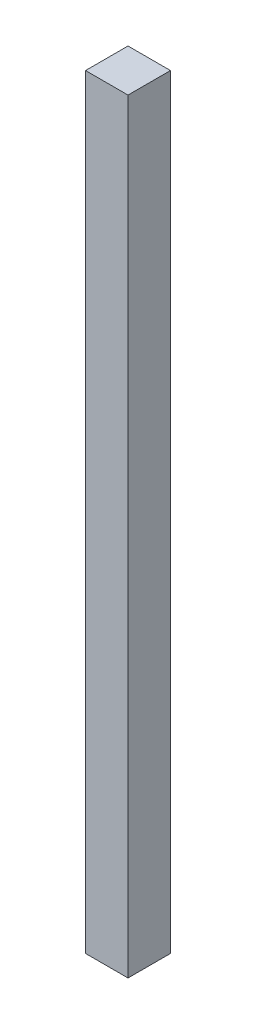
ISO-10303-21;
HEADER;
FILE_DESCRIPTION(('STEP AP214'),'2;1');
FILE_NAME('part.step','',(''),(''),'','','');
FILE_SCHEMA(('AUTOMOTIVE_DESIGN { 1 0 10303 214 1 1 1 1 }'));
ENDSEC;
DATA;
#1=APPLICATION_CONTEXT('core data for automotive mechanical design processes');
#2=APPLICATION_PROTOCOL_DEFINITION('international standard','automotive_design',2000,#1);
#3=PRODUCT_CONTEXT('',#1,'mechanical');
#4=PRODUCT('Part','Part','',(#3));
#5=PRODUCT_RELATED_PRODUCT_CATEGORY('part','',(#4));
#6=PRODUCT_DEFINITION_FORMATION('','',#4);
#7=PRODUCT_DEFINITION_CONTEXT('part definition',#1,'design');
#8=PRODUCT_DEFINITION('design','',#6,#7);
#9=PRODUCT_DEFINITION_SHAPE('','',#8);
#10=(LENGTH_UNIT() NAMED_UNIT(*) SI_UNIT(.MILLI.,.METRE.));
#11=(NAMED_UNIT(*) PLANE_ANGLE_UNIT() SI_UNIT($,.RADIAN.));
#12=(NAMED_UNIT(*) SI_UNIT($,.STERADIAN.) SOLID_ANGLE_UNIT());
#13=UNCERTAINTY_MEASURE_WITH_UNIT(LENGTH_MEASURE(1.E-05),#10,'distance_accuracy_value','');
#14=(GEOMETRIC_REPRESENTATION_CONTEXT(3) GLOBAL_UNCERTAINTY_ASSIGNED_CONTEXT((#13)) GLOBAL_UNIT_ASSIGNED_CONTEXT((#10,
#11,#12)) REPRESENTATION_CONTEXT('',''));
#15=CARTESIAN_POINT('',(0.,0.,0.));
#16=DIRECTION('',(0.,0.,1.));
#17=DIRECTION('',(1.,0.,0.));
#18=AXIS2_PLACEMENT_3D('',#15,#16,#17);
#19=CARTESIAN_POINT('',(0.,685.8,0.));
#20=DIRECTION('',(1.,0.,0.));
#21=DIRECTION('',(0.,0.,-1.));
#22=AXIS2_PLACEMENT_3D('',#19,#20,#21);
#23=PLANE('',#22);
#24=DIRECTION('',(0.,0.,1.));
#25=VECTOR('',#24,1.);
#26=CARTESIAN_POINT('',(0.,0.,0.));
#27=LINE('',#26,#25);
#28=CARTESIAN_POINT('',(0.,0.,0.));
#29=VERTEX_POINT('',#28);
#30=CARTESIAN_POINT('',(0.,0.,38.1));
#31=VERTEX_POINT('',#30);
#32=EDGE_CURVE('E96',#29,#31,#27,.T.);
#33=ORIENTED_EDGE('',*,*,#32,.T.);
#34=DIRECTION('',(0.,-1.,0.));
#35=VECTOR('',#34,1.);
#36=CARTESIAN_POINT('',(0.,685.8,38.1));
#37=LINE('',#36,#35);
#38=CARTESIAN_POINT('',(0.,685.8,38.1));
#39=VERTEX_POINT('',#38);
#40=EDGE_CURVE('E11',#39,#31,#37,.T.);
#41=ORIENTED_EDGE('',*,*,#40,.F.);
#42=DIRECTION('',(0.,0.,1.));
#43=VECTOR('',#42,1.);
#44=CARTESIAN_POINT('',(0.,685.8,0.));
#45=LINE('',#44,#43);
#46=CARTESIAN_POINT('',(0.,685.8,0.));
#47=VERTEX_POINT('',#46);
#48=EDGE_CURVE('E84',#47,#39,#45,.T.);
#49=ORIENTED_EDGE('',*,*,#48,.F.);
#50=DIRECTION('',(0.,-1.,0.));
#51=VECTOR('',#50,1.);
#52=CARTESIAN_POINT('',(0.,685.8,0.));
#53=LINE('',#52,#51);
#54=EDGE_CURVE('E92',#47,#29,#53,.T.);
#55=ORIENTED_EDGE('',*,*,#54,.T.);
#56=EDGE_LOOP('',(#33,#41,#49,#55));
#57=FACE_BOUND('',#56,.T.);
#58=ADVANCED_FACE('F33',(#57),#23,.F.);
#59=CARTESIAN_POINT('',(0.,685.8,38.1));
#60=DIRECTION('',(0.,0.,-1.));
#61=DIRECTION('',(-1.,0.,0.));
#62=AXIS2_PLACEMENT_3D('',#59,#60,#61);
#63=PLANE('',#62);
#64=DIRECTION('',(1.,0.,0.));
#65=VECTOR('',#64,1.);
#66=CARTESIAN_POINT('',(0.,0.,38.1));
#67=LINE('',#66,#65);
#68=CARTESIAN_POINT('',(38.1,0.,38.1));
#69=VERTEX_POINT('',#68);
#70=EDGE_CURVE('E88',#31,#69,#67,.T.);
#71=ORIENTED_EDGE('',*,*,#70,.T.);
#72=DIRECTION('',(0.,-1.,0.));
#73=VECTOR('',#72,1.);
#74=CARTESIAN_POINT('',(38.1,685.8,38.1));
#75=LINE('',#74,#73);
#76=CARTESIAN_POINT('',(38.1,685.8,38.1));
#77=VERTEX_POINT('',#76);
#78=EDGE_CURVE('E41',#77,#69,#75,.T.);
#79=ORIENTED_EDGE('',*,*,#78,.F.);
#80=DIRECTION('',(1.,0.,0.));
#81=VECTOR('',#80,1.);
#82=CARTESIAN_POINT('',(0.,685.8,38.1));
#83=LINE('',#82,#81);
#84=EDGE_CURVE('E79',#39,#77,#83,.T.);
#85=ORIENTED_EDGE('',*,*,#84,.F.);
#86=ORIENTED_EDGE('',*,*,#40,.T.);
#87=EDGE_LOOP('',(#71,#79,#85,#86));
#88=FACE_BOUND('',#87,.T.);
#89=ADVANCED_FACE('F87',(#88),#63,.F.);
#90=CARTESIAN_POINT('',(38.1,685.8,0.));
#91=DIRECTION('',(-1.,0.,0.));
#92=DIRECTION('',(0.,0.,1.));
#93=AXIS2_PLACEMENT_3D('',#90,#91,#92);
#94=PLANE('',#93);
#95=DIRECTION('',(0.,0.,-1.));
#96=VECTOR('',#95,1.);
#97=CARTESIAN_POINT('',(38.1,0.,0.));
#98=LINE('',#97,#96);
#99=CARTESIAN_POINT('',(38.1,0.,0.));
#100=VERTEX_POINT('',#99);
#101=EDGE_CURVE('E66',#69,#100,#98,.T.);
#102=ORIENTED_EDGE('',*,*,#101,.T.);
#103=DIRECTION('',(0.,-1.,0.));
#104=VECTOR('',#103,1.);
#105=CARTESIAN_POINT('',(38.1,685.8,0.));
#106=LINE('',#105,#104);
#107=CARTESIAN_POINT('',(38.1,685.8,0.));
#108=VERTEX_POINT('',#107);
#109=EDGE_CURVE('E89',#108,#100,#106,.T.);
#110=ORIENTED_EDGE('',*,*,#109,.F.);
#111=DIRECTION('',(0.,0.,-1.));
#112=VECTOR('',#111,1.);
#113=CARTESIAN_POINT('',(38.1,685.8,0.));
#114=LINE('',#113,#112);
#115=EDGE_CURVE('E82',#77,#108,#114,.T.);
#116=ORIENTED_EDGE('',*,*,#115,.F.);
#117=ORIENTED_EDGE('',*,*,#78,.T.);
#118=EDGE_LOOP('',(#102,#110,#116,#117));
#119=FACE_BOUND('',#118,.T.);
#120=ADVANCED_FACE('F90',(#119),#94,.F.);
#121=CARTESIAN_POINT('',(0.,685.8,0.));
#122=DIRECTION('',(0.,0.,1.));
#123=DIRECTION('',(1.,0.,0.));
#124=AXIS2_PLACEMENT_3D('',#121,#122,#123);
#125=PLANE('',#124);
#126=DIRECTION('',(-1.,0.,0.));
#127=VECTOR('',#126,1.);
#128=CARTESIAN_POINT('',(0.,0.,0.));
#129=LINE('',#128,#127);
#130=EDGE_CURVE('E72',#100,#29,#129,.T.);
#131=ORIENTED_EDGE('',*,*,#130,.T.);
#132=ORIENTED_EDGE('',*,*,#54,.F.);
#133=DIRECTION('',(-1.,0.,0.));
#134=VECTOR('',#133,1.);
#135=CARTESIAN_POINT('',(0.,685.8,0.));
#136=LINE('',#135,#134);
#137=EDGE_CURVE('E49',#108,#47,#136,.T.);
#138=ORIENTED_EDGE('',*,*,#137,.F.);
#139=ORIENTED_EDGE('',*,*,#109,.T.);
#140=EDGE_LOOP('',(#131,#132,#138,#139));
#141=FACE_BOUND('',#140,.T.);
#142=ADVANCED_FACE('F103',(#141),#125,.F.);
#143=CARTESIAN_POINT('',(0.,685.8,0.));
#144=DIRECTION('',(0.,1.,0.));
#145=DIRECTION('',(0.,0.,1.));
#146=AXIS2_PLACEMENT_3D('',#143,#144,#145);
#147=PLANE('',#146);
#148=ORIENTED_EDGE('',*,*,#48,.T.);
#149=ORIENTED_EDGE('',*,*,#84,.T.);
#150=ORIENTED_EDGE('',*,*,#115,.T.);
#151=ORIENTED_EDGE('',*,*,#137,.T.);
#152=EDGE_LOOP('',(#148,#149,#150,#151));
#153=FACE_BOUND('',#152,.T.);
#154=ADVANCED_FACE('F80',(#153),#147,.T.);
#155=CARTESIAN_POINT('',(0.,0.,0.));
#156=DIRECTION('',(0.,1.,0.));
#157=DIRECTION('',(0.,0.,1.));
#158=AXIS2_PLACEMENT_3D('',#155,#156,#157);
#159=PLANE('',#158);
#160=ORIENTED_EDGE('',*,*,#32,.F.);
#161=ORIENTED_EDGE('',*,*,#130,.F.);
#162=ORIENTED_EDGE('',*,*,#101,.F.);
#163=ORIENTED_EDGE('',*,*,#70,.F.);
#164=EDGE_LOOP('',(#160,#161,#162,#163));
#165=FACE_BOUND('',#164,.T.);
#166=ADVANCED_FACE('F106',(#165),#159,.F.);
#167=CLOSED_SHELL('',(#58,#89,#120,#142,#154,#166));
#168=MANIFOLD_SOLID_BREP('B2',#167);
#169=ADVANCED_BREP_SHAPE_REPRESENTATION('',(#18,#168),#14);
#170=SHAPE_DEFINITION_REPRESENTATION(#9,#169);
ENDSEC;
END-ISO-10303-21;
